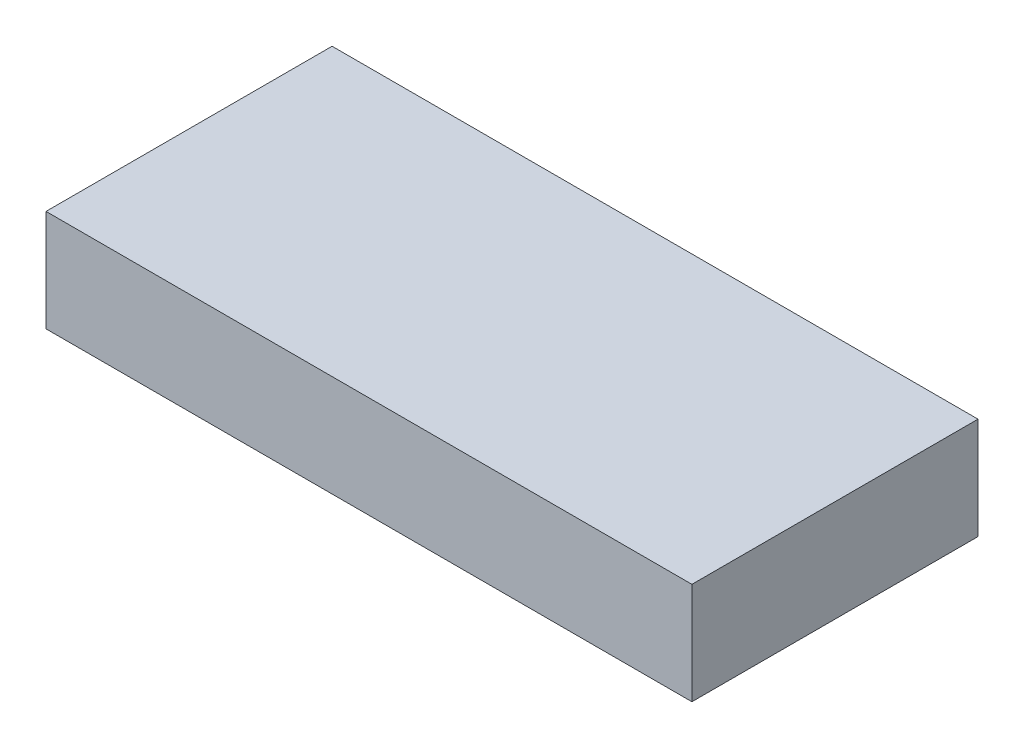
ISO-10303-21;
HEADER;
FILE_DESCRIPTION(('STEP AP214'),'2;1');
FILE_NAME('part.step','',(''),(''),'','','');
FILE_SCHEMA(('AUTOMOTIVE_DESIGN { 1 0 10303 214 1 1 1 1 }'));
ENDSEC;
DATA;
#1=APPLICATION_CONTEXT('core data for automotive mechanical design processes');
#2=APPLICATION_PROTOCOL_DEFINITION('international standard','automotive_design',2000,#1);
#3=PRODUCT_CONTEXT('',#1,'mechanical');
#4=PRODUCT('Part','Part','',(#3));
#5=PRODUCT_RELATED_PRODUCT_CATEGORY('part','',(#4));
#6=PRODUCT_DEFINITION_FORMATION('','',#4);
#7=PRODUCT_DEFINITION_CONTEXT('part definition',#1,'design');
#8=PRODUCT_DEFINITION('design','',#6,#7);
#9=PRODUCT_DEFINITION_SHAPE('','',#8);
#10=(LENGTH_UNIT() NAMED_UNIT(*) SI_UNIT(.MILLI.,.METRE.));
#11=(NAMED_UNIT(*) PLANE_ANGLE_UNIT() SI_UNIT($,.RADIAN.));
#12=(NAMED_UNIT(*) SI_UNIT($,.STERADIAN.) SOLID_ANGLE_UNIT());
#13=UNCERTAINTY_MEASURE_WITH_UNIT(LENGTH_MEASURE(1.E-05),#10,'distance_accuracy_value','');
#14=(GEOMETRIC_REPRESENTATION_CONTEXT(3) GLOBAL_UNCERTAINTY_ASSIGNED_CONTEXT((#13)) GLOBAL_UNIT_ASSIGNED_CONTEXT((#10,
#11,#12)) REPRESENTATION_CONTEXT('',''));
#15=CARTESIAN_POINT('',(0.,0.,0.));
#16=DIRECTION('',(0.,0.,1.));
#17=DIRECTION('',(1.,0.,0.));
#18=AXIS2_PLACEMENT_3D('',#15,#16,#17);
#19=CARTESIAN_POINT('',(15.24,4.8,6.75));
#20=DIRECTION('',(-1.,0.,0.));
#21=DIRECTION('',(0.,0.,1.));
#22=AXIS2_PLACEMENT_3D('',#19,#20,#21);
#23=PLANE('',#22);
#24=DIRECTION('',(0.,0.,-1.));
#25=VECTOR('',#24,1.);
#26=CARTESIAN_POINT('',(15.24,0.,6.75));
#27=LINE('',#26,#25);
#28=CARTESIAN_POINT('',(15.24,0.,6.75));
#29=VERTEX_POINT('',#28);
#30=CARTESIAN_POINT('',(15.24,0.,-6.75));
#31=VERTEX_POINT('',#30);
#32=EDGE_CURVE('E96',#29,#31,#27,.T.);
#33=ORIENTED_EDGE('',*,*,#32,.T.);
#34=DIRECTION('',(0.,-1.,0.));
#35=VECTOR('',#34,1.);
#36=CARTESIAN_POINT('',(15.24,4.8,-6.75));
#37=LINE('',#36,#35);
#38=CARTESIAN_POINT('',(15.24,4.8,-6.75));
#39=VERTEX_POINT('',#38);
#40=EDGE_CURVE('E11',#39,#31,#37,.T.);
#41=ORIENTED_EDGE('',*,*,#40,.F.);
#42=DIRECTION('',(0.,0.,-1.));
#43=VECTOR('',#42,1.);
#44=CARTESIAN_POINT('',(15.24,4.8,6.75));
#45=LINE('',#44,#43);
#46=CARTESIAN_POINT('',(15.24,4.8,6.75));
#47=VERTEX_POINT('',#46);
#48=EDGE_CURVE('E84',#47,#39,#45,.T.);
#49=ORIENTED_EDGE('',*,*,#48,.F.);
#50=DIRECTION('',(0.,-1.,0.));
#51=VECTOR('',#50,1.);
#52=CARTESIAN_POINT('',(15.24,4.8,6.75));
#53=LINE('',#52,#51);
#54=EDGE_CURVE('E92',#47,#29,#53,.T.);
#55=ORIENTED_EDGE('',*,*,#54,.T.);
#56=EDGE_LOOP('',(#33,#41,#49,#55));
#57=FACE_BOUND('',#56,.T.);
#58=ADVANCED_FACE('F33',(#57),#23,.F.);
#59=CARTESIAN_POINT('',(-15.24,4.8,-6.75));
#60=DIRECTION('',(0.,0.,1.));
#61=DIRECTION('',(1.,0.,0.));
#62=AXIS2_PLACEMENT_3D('',#59,#60,#61);
#63=PLANE('',#62);
#64=DIRECTION('',(-1.,0.,0.));
#65=VECTOR('',#64,1.);
#66=CARTESIAN_POINT('',(-15.24,0.,-6.75));
#67=LINE('',#66,#65);
#68=CARTESIAN_POINT('',(-15.24,0.,-6.75));
#69=VERTEX_POINT('',#68);
#70=EDGE_CURVE('E88',#31,#69,#67,.T.);
#71=ORIENTED_EDGE('',*,*,#70,.T.);
#72=DIRECTION('',(0.,-1.,0.));
#73=VECTOR('',#72,1.);
#74=CARTESIAN_POINT('',(-15.24,4.8,-6.75));
#75=LINE('',#74,#73);
#76=CARTESIAN_POINT('',(-15.24,4.8,-6.75));
#77=VERTEX_POINT('',#76);
#78=EDGE_CURVE('E41',#77,#69,#75,.T.);
#79=ORIENTED_EDGE('',*,*,#78,.F.);
#80=DIRECTION('',(-1.,0.,0.));
#81=VECTOR('',#80,1.);
#82=CARTESIAN_POINT('',(-15.24,4.8,-6.75));
#83=LINE('',#82,#81);
#84=EDGE_CURVE('E79',#39,#77,#83,.T.);
#85=ORIENTED_EDGE('',*,*,#84,.F.);
#86=ORIENTED_EDGE('',*,*,#40,.T.);
#87=EDGE_LOOP('',(#71,#79,#85,#86));
#88=FACE_BOUND('',#87,.T.);
#89=ADVANCED_FACE('F87',(#88),#63,.F.);
#90=CARTESIAN_POINT('',(-15.24,4.8,6.75));
#91=DIRECTION('',(1.,0.,0.));
#92=DIRECTION('',(0.,0.,-1.));
#93=AXIS2_PLACEMENT_3D('',#90,#91,#92);
#94=PLANE('',#93);
#95=DIRECTION('',(0.,0.,1.));
#96=VECTOR('',#95,1.);
#97=CARTESIAN_POINT('',(-15.24,0.,6.75));
#98=LINE('',#97,#96);
#99=CARTESIAN_POINT('',(-15.24,0.,6.75));
#100=VERTEX_POINT('',#99);
#101=EDGE_CURVE('E66',#69,#100,#98,.T.);
#102=ORIENTED_EDGE('',*,*,#101,.T.);
#103=DIRECTION('',(0.,-1.,0.));
#104=VECTOR('',#103,1.);
#105=CARTESIAN_POINT('',(-15.24,4.8,6.75));
#106=LINE('',#105,#104);
#107=CARTESIAN_POINT('',(-15.24,4.8,6.75));
#108=VERTEX_POINT('',#107);
#109=EDGE_CURVE('E89',#108,#100,#106,.T.);
#110=ORIENTED_EDGE('',*,*,#109,.F.);
#111=DIRECTION('',(0.,0.,1.));
#112=VECTOR('',#111,1.);
#113=CARTESIAN_POINT('',(-15.24,4.8,6.75));
#114=LINE('',#113,#112);
#115=EDGE_CURVE('E82',#77,#108,#114,.T.);
#116=ORIENTED_EDGE('',*,*,#115,.F.);
#117=ORIENTED_EDGE('',*,*,#78,.T.);
#118=EDGE_LOOP('',(#102,#110,#116,#117));
#119=FACE_BOUND('',#118,.T.);
#120=ADVANCED_FACE('F90',(#119),#94,.F.);
#121=CARTESIAN_POINT('',(-15.24,4.8,6.75));
#122=DIRECTION('',(0.,0.,-1.));
#123=DIRECTION('',(-1.,0.,0.));
#124=AXIS2_PLACEMENT_3D('',#121,#122,#123);
#125=PLANE('',#124);
#126=DIRECTION('',(1.,0.,0.));
#127=VECTOR('',#126,1.);
#128=CARTESIAN_POINT('',(-15.24,0.,6.75));
#129=LINE('',#128,#127);
#130=EDGE_CURVE('E72',#100,#29,#129,.T.);
#131=ORIENTED_EDGE('',*,*,#130,.T.);
#132=ORIENTED_EDGE('',*,*,#54,.F.);
#133=DIRECTION('',(1.,0.,0.));
#134=VECTOR('',#133,1.);
#135=CARTESIAN_POINT('',(-15.24,4.8,6.75));
#136=LINE('',#135,#134);
#137=EDGE_CURVE('E49',#108,#47,#136,.T.);
#138=ORIENTED_EDGE('',*,*,#137,.F.);
#139=ORIENTED_EDGE('',*,*,#109,.T.);
#140=EDGE_LOOP('',(#131,#132,#138,#139));
#141=FACE_BOUND('',#140,.T.);
#142=ADVANCED_FACE('F103',(#141),#125,.F.);
#143=CARTESIAN_POINT('',(0.,4.8,0.));
#144=DIRECTION('',(0.,-1.,0.));
#145=DIRECTION('',(0.,0.,-1.));
#146=AXIS2_PLACEMENT_3D('',#143,#144,#145);
#147=PLANE('',#146);
#148=ORIENTED_EDGE('',*,*,#48,.T.);
#149=ORIENTED_EDGE('',*,*,#84,.T.);
#150=ORIENTED_EDGE('',*,*,#115,.T.);
#151=ORIENTED_EDGE('',*,*,#137,.T.);
#152=EDGE_LOOP('',(#148,#149,#150,#151));
#153=FACE_BOUND('',#152,.T.);
#154=ADVANCED_FACE('F80',(#153),#147,.F.);
#155=CARTESIAN_POINT('',(0.,0.,0.));
#156=DIRECTION('',(0.,-1.,0.));
#157=DIRECTION('',(0.,0.,-1.));
#158=AXIS2_PLACEMENT_3D('',#155,#156,#157);
#159=PLANE('',#158);
#160=ORIENTED_EDGE('',*,*,#32,.F.);
#161=ORIENTED_EDGE('',*,*,#130,.F.);
#162=ORIENTED_EDGE('',*,*,#101,.F.);
#163=ORIENTED_EDGE('',*,*,#70,.F.);
#164=EDGE_LOOP('',(#160,#161,#162,#163));
#165=FACE_BOUND('',#164,.T.);
#166=ADVANCED_FACE('F106',(#165),#159,.T.);
#167=CLOSED_SHELL('',(#58,#89,#120,#142,#154,#166));
#168=MANIFOLD_SOLID_BREP('B2',#167);
#169=ADVANCED_BREP_SHAPE_REPRESENTATION('',(#18,#168),#14);
#170=SHAPE_DEFINITION_REPRESENTATION(#9,#169);
ENDSEC;
END-ISO-10303-21;
